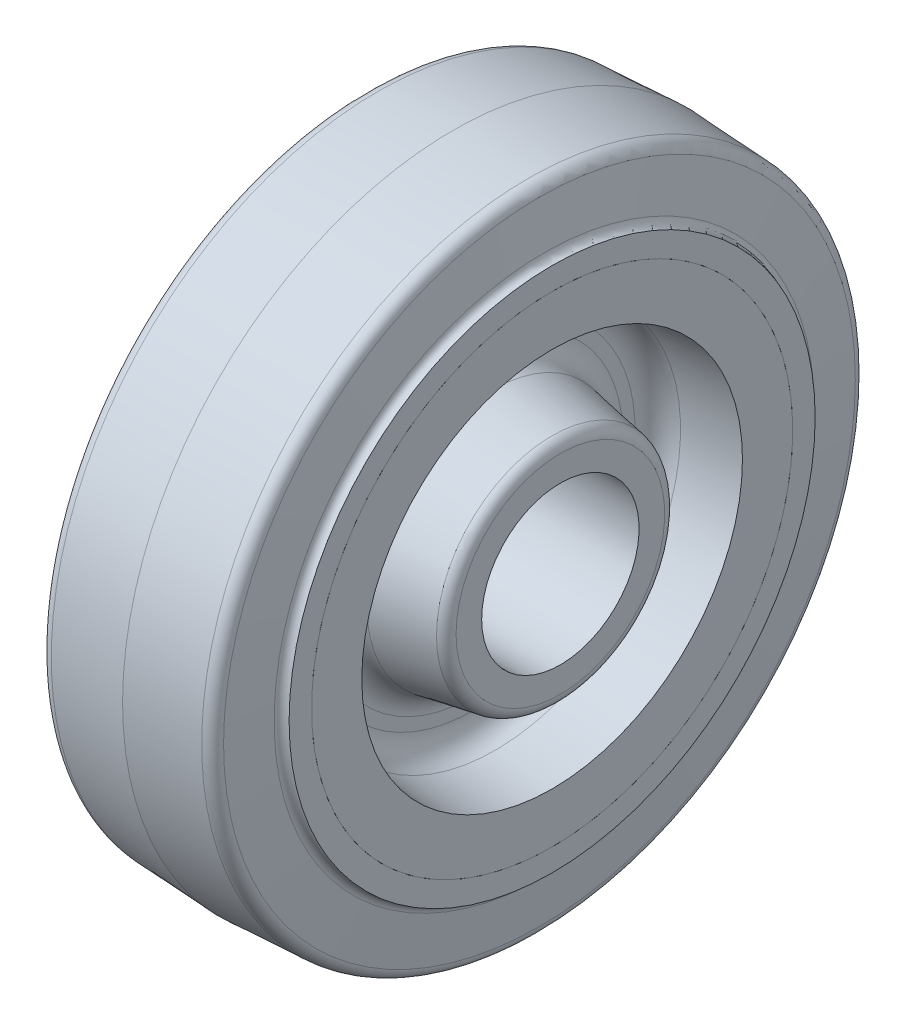
ISO-10303-21;
HEADER;
FILE_DESCRIPTION(('STEP AP214'),'2;1');
FILE_NAME('part.step','',(''),(''),'','','');
FILE_SCHEMA(('AUTOMOTIVE_DESIGN { 1 0 10303 214 1 1 1 1 }'));
ENDSEC;
DATA;
#1=APPLICATION_CONTEXT('core data for automotive mechanical design processes');
#2=APPLICATION_PROTOCOL_DEFINITION('international standard','automotive_design',2000,#1);
#3=PRODUCT_CONTEXT('',#1,'mechanical');
#4=PRODUCT('Part','Part','',(#3));
#5=PRODUCT_RELATED_PRODUCT_CATEGORY('part','',(#4));
#6=PRODUCT_DEFINITION_FORMATION('','',#4);
#7=PRODUCT_DEFINITION_CONTEXT('part definition',#1,'design');
#8=PRODUCT_DEFINITION('design','',#6,#7);
#9=PRODUCT_DEFINITION_SHAPE('','',#8);
#10=(LENGTH_UNIT() NAMED_UNIT(*) SI_UNIT(.MILLI.,.METRE.));
#11=(NAMED_UNIT(*) PLANE_ANGLE_UNIT() SI_UNIT($,.RADIAN.));
#12=(NAMED_UNIT(*) SI_UNIT($,.STERADIAN.) SOLID_ANGLE_UNIT());
#13=UNCERTAINTY_MEASURE_WITH_UNIT(LENGTH_MEASURE(1.E-05),#10,'distance_accuracy_value','');
#14=(GEOMETRIC_REPRESENTATION_CONTEXT(3) GLOBAL_UNCERTAINTY_ASSIGNED_CONTEXT((#13)) GLOBAL_UNIT_ASSIGNED_CONTEXT((#10,
#11,#12)) REPRESENTATION_CONTEXT('',''));
#15=CARTESIAN_POINT('',(0.,0.,0.));
#16=DIRECTION('',(0.,0.,1.));
#17=DIRECTION('',(1.,0.,0.));
#18=AXIS2_PLACEMENT_3D('',#15,#16,#17);
#19=CARTESIAN_POINT('',(19.05,50.546,0.));
#20=DIRECTION('',(1.,0.,0.));
#21=DIRECTION('',(0.,0.,-1.));
#22=AXIS2_PLACEMENT_3D('',#19,#20,#21);
#23=PLANE('',#22);
#24=CARTESIAN_POINT('',(19.05,0.,0.));
#25=DIRECTION('',(1.,0.,0.));
#26=DIRECTION('',(0.,0.,-1.));
#27=AXIS2_PLACEMENT_3D('',#24,#25,#26);
#28=CIRCLE('',#27,50.546);
#29=CARTESIAN_POINT('',(19.05,0.,-50.546));
#30=VERTEX_POINT('',#29);
#31=EDGE_CURVE('P0_E10',#30,#30,#28,.T.);
#32=ORIENTED_EDGE('',*,*,#31,.T.);
#33=EDGE_LOOP('',(#32));
#34=FACE_BOUND('',#33,.T.);
#35=CARTESIAN_POINT('',(19.05,0.,0.));
#36=DIRECTION('',(1.,0.,0.));
#37=DIRECTION('',(0.,0.,-1.));
#38=AXIS2_PLACEMENT_3D('',#35,#36,#37);
#39=CIRCLE('',#38,46.228);
#40=CARTESIAN_POINT('',(19.05,0.,-46.228));
#41=VERTEX_POINT('',#40);
#42=EDGE_CURVE('P0_E63',#41,#41,#39,.T.);
#43=ORIENTED_EDGE('',*,*,#42,.F.);
#44=EDGE_LOOP('',(#43));
#45=FACE_BOUND('',#44,.T.);
#46=ADVANCED_FACE('P0_F14',(#34,#45),#23,.T.);
#47=CARTESIAN_POINT('',(19.05,0.,0.));
#48=DIRECTION('',(1.,0.,0.));
#49=DIRECTION('',(0.,0.,-1.));
#50=AXIS2_PLACEMENT_3D('',#47,#48,#49);
#51=TOROIDAL_SURFACE('',#50,52.07,1.524);
#52=CARTESIAN_POINT('',(17.5343486314588,0.,0.));
#53=DIRECTION('',(1.,0.,0.));
#54=DIRECTION('',(0.,0.,-1.));
#55=AXIS2_PLACEMENT_3D('',#52,#53,#54);
#56=CIRCLE('',#55,51.9106986219801);
#57=CARTESIAN_POINT('',(17.5343486314588,0.,-51.9106986219801));
#58=VERTEX_POINT('',#57);
#59=EDGE_CURVE('P0_E20',#58,#58,#56,.T.);
#60=ORIENTED_EDGE('',*,*,#59,.T.);
#61=EDGE_LOOP('',(#60));
#62=FACE_BOUND('',#61,.T.);
#63=ORIENTED_EDGE('',*,*,#31,.F.);
#64=EDGE_LOOP('',(#63));
#65=FACE_BOUND('',#64,.T.);
#66=ADVANCED_FACE('P0_F71',(#62,#65),#51,.F.);
#67=CARTESIAN_POINT('',(17.5343486314588,0.,0.));
#68=DIRECTION('',(-1.,0.,0.));
#69=DIRECTION('',(0.,0.,1.));
#70=AXIS2_PLACEMENT_3D('',#67,#68,#69);
#71=CONICAL_SURFACE('',#70,51.9106986219801,1.46607657167524);
#72=CARTESIAN_POINT('',(16.6107206575658,0.,0.));
#73=DIRECTION('',(1.,0.,0.));
#74=DIRECTION('',(0.,0.,-1.));
#75=AXIS2_PLACEMENT_3D('',#72,#73,#74);
#76=CIRCLE('',#75,60.6984317857136);
#77=CARTESIAN_POINT('',(16.6107206575658,0.,-60.6984317857136));
#78=VERTEX_POINT('',#77);
#79=EDGE_CURVE('P0_E24',#78,#78,#76,.T.);
#80=ORIENTED_EDGE('',*,*,#79,.T.);
#81=EDGE_LOOP('',(#80));
#82=FACE_BOUND('',#81,.T.);
#83=ORIENTED_EDGE('',*,*,#59,.F.);
#84=EDGE_LOOP('',(#83));
#85=FACE_BOUND('',#84,.T.);
#86=ADVANCED_FACE('P0_F76',(#82,#85),#71,.T.);
#87=CARTESIAN_POINT('',(14.3372436047539,0.,0.));
#88=DIRECTION('',(1.,0.,0.));
#89=DIRECTION('',(0.,0.,-1.));
#90=AXIS2_PLACEMENT_3D('',#87,#88,#89);
#91=TOROIDAL_SURFACE('',#90,60.4594797186837,2.286);
#92=CARTESIAN_POINT('',(14.4568836007253,0.,0.));
#93=DIRECTION('',(1.,0.,0.));
#94=DIRECTION('',(0.,0.,-1.));
#95=AXIS2_PLACEMENT_3D('',#92,#93,#94);
#96=CIRCLE('',#95,62.7423468351327);
#97=CARTESIAN_POINT('',(14.4568836007253,0.,-62.7423468351327));
#98=VERTEX_POINT('',#97);
#99=EDGE_CURVE('P0_E28',#98,#98,#96,.T.);
#100=ORIENTED_EDGE('',*,*,#99,.T.);
#101=EDGE_LOOP('',(#100));
#102=FACE_BOUND('',#101,.T.);
#103=ORIENTED_EDGE('',*,*,#79,.F.);
#104=EDGE_LOOP('',(#103));
#105=FACE_BOUND('',#104,.T.);
#106=ADVANCED_FACE('P0_F80',(#102,#105),#91,.T.);
#107=CARTESIAN_POINT('',(14.4568836007253,0.,0.));
#108=DIRECTION('',(-1.,0.,0.));
#109=DIRECTION('',(0.,0.,1.));
#110=AXIS2_PLACEMENT_3D('',#107,#108,#109);
#111=CONICAL_SURFACE('',#110,62.7423468351327,0.0523598775598219);
#112=CARTESIAN_POINT('',(0.,0.,0.));
#113=DIRECTION('',(1.,0.,0.));
#114=DIRECTION('',(0.,0.,-1.));
#115=AXIS2_PLACEMENT_3D('',#112,#113,#114);
#116=CIRCLE('',#115,63.5);
#117=CARTESIAN_POINT('',(0.,0.,-63.5));
#118=VERTEX_POINT('',#117);
#119=EDGE_CURVE('P0_E33',#118,#118,#116,.T.);
#120=ORIENTED_EDGE('',*,*,#119,.T.);
#121=EDGE_LOOP('',(#120));
#122=FACE_BOUND('',#121,.T.);
#123=ORIENTED_EDGE('',*,*,#99,.F.);
#124=EDGE_LOOP('',(#123));
#125=FACE_BOUND('',#124,.T.);
#126=ADVANCED_FACE('P0_F87',(#122,#125),#111,.T.);
#127=CARTESIAN_POINT('',(0.,0.,0.));
#128=DIRECTION('',(1.,0.,0.));
#129=DIRECTION('',(0.,0.,-1.));
#130=AXIS2_PLACEMENT_3D('',#127,#128,#129);
#131=CONICAL_SURFACE('',#130,63.5,0.0523598775598228);
#132=CARTESIAN_POINT('',(-14.4568836007253,0.,0.));
#133=DIRECTION('',(1.,0.,0.));
#134=DIRECTION('',(0.,0.,-1.));
#135=AXIS2_PLACEMENT_3D('',#132,#133,#134);
#136=CIRCLE('',#135,62.7423468351327);
#137=CARTESIAN_POINT('',(-14.4568836007253,0.,-62.7423468351327));
#138=VERTEX_POINT('',#137);
#139=EDGE_CURVE('P0_E36',#138,#138,#136,.T.);
#140=ORIENTED_EDGE('',*,*,#139,.T.);
#141=EDGE_LOOP('',(#140));
#142=FACE_BOUND('',#141,.T.);
#143=ORIENTED_EDGE('',*,*,#119,.F.);
#144=EDGE_LOOP('',(#143));
#145=FACE_BOUND('',#144,.T.);
#146=ADVANCED_FACE('P0_F91',(#142,#145),#131,.T.);
#147=CARTESIAN_POINT('',(-14.3372436047539,0.,0.));
#148=DIRECTION('',(1.,0.,0.));
#149=DIRECTION('',(0.,0.,-1.));
#150=AXIS2_PLACEMENT_3D('',#147,#148,#149);
#151=TOROIDAL_SURFACE('',#150,60.4594797186837,2.286);
#152=CARTESIAN_POINT('',(-16.6107206575658,0.,0.));
#153=DIRECTION('',(1.,0.,0.));
#154=DIRECTION('',(0.,0.,-1.));
#155=AXIS2_PLACEMENT_3D('',#152,#153,#154);
#156=CIRCLE('',#155,60.6984317857136);
#157=CARTESIAN_POINT('',(-16.6107206575658,0.,-60.6984317857136));
#158=VERTEX_POINT('',#157);
#159=EDGE_CURVE('P0_E39',#158,#158,#156,.T.);
#160=ORIENTED_EDGE('',*,*,#159,.T.);
#161=EDGE_LOOP('',(#160));
#162=FACE_BOUND('',#161,.T.);
#163=ORIENTED_EDGE('',*,*,#139,.F.);
#164=EDGE_LOOP('',(#163));
#165=FACE_BOUND('',#164,.T.);
#166=ADVANCED_FACE('P0_F95',(#162,#165),#151,.T.);
#167=CARTESIAN_POINT('',(-16.6107206575658,0.,0.));
#168=DIRECTION('',(1.,0.,0.));
#169=DIRECTION('',(0.,0.,-1.));
#170=AXIS2_PLACEMENT_3D('',#167,#168,#169);
#171=CONICAL_SURFACE('',#170,60.6984317857136,1.46607657167524);
#172=CARTESIAN_POINT('',(-17.5343486314587,0.,0.));
#173=DIRECTION('',(1.,0.,0.));
#174=DIRECTION('',(0.,0.,-1.));
#175=AXIS2_PLACEMENT_3D('',#172,#173,#174);
#176=CIRCLE('',#175,51.9106986219801);
#177=CARTESIAN_POINT('',(-17.5343486314587,0.,-51.9106986219801));
#178=VERTEX_POINT('',#177);
#179=EDGE_CURVE('P0_E42',#178,#178,#176,.T.);
#180=ORIENTED_EDGE('',*,*,#179,.T.);
#181=EDGE_LOOP('',(#180));
#182=FACE_BOUND('',#181,.T.);
#183=ORIENTED_EDGE('',*,*,#159,.F.);
#184=EDGE_LOOP('',(#183));
#185=FACE_BOUND('',#184,.T.);
#186=ADVANCED_FACE('P0_F99',(#182,#185),#171,.T.);
#187=CARTESIAN_POINT('',(-19.05,0.,0.));
#188=DIRECTION('',(1.,0.,0.));
#189=DIRECTION('',(0.,0.,-1.));
#190=AXIS2_PLACEMENT_3D('',#187,#188,#189);
#191=TOROIDAL_SURFACE('',#190,52.07,1.524);
#192=CARTESIAN_POINT('',(-19.05,0.,0.));
#193=DIRECTION('',(1.,0.,0.));
#194=DIRECTION('',(0.,0.,-1.));
#195=AXIS2_PLACEMENT_3D('',#192,#193,#194);
#196=CIRCLE('',#195,50.546);
#197=CARTESIAN_POINT('',(-19.05,0.,-50.546));
#198=VERTEX_POINT('',#197);
#199=EDGE_CURVE('P0_E45',#198,#198,#196,.T.);
#200=ORIENTED_EDGE('',*,*,#199,.T.);
#201=EDGE_LOOP('',(#200));
#202=FACE_BOUND('',#201,.T.);
#203=ORIENTED_EDGE('',*,*,#179,.F.);
#204=EDGE_LOOP('',(#203));
#205=FACE_BOUND('',#204,.T.);
#206=ADVANCED_FACE('P0_F103',(#202,#205),#191,.F.);
#207=CARTESIAN_POINT('',(-19.05,46.228,0.));
#208=DIRECTION('',(-1.,0.,0.));
#209=DIRECTION('',(0.,0.,1.));
#210=AXIS2_PLACEMENT_3D('',#207,#208,#209);
#211=PLANE('',#210);
#212=CARTESIAN_POINT('',(-19.05,0.,0.));
#213=DIRECTION('',(1.,0.,0.));
#214=DIRECTION('',(0.,0.,-1.));
#215=AXIS2_PLACEMENT_3D('',#212,#213,#214);
#216=CIRCLE('',#215,46.228);
#217=CARTESIAN_POINT('',(-19.05,0.,-46.228));
#218=VERTEX_POINT('',#217);
#219=EDGE_CURVE('P0_E48',#218,#218,#216,.T.);
#220=ORIENTED_EDGE('',*,*,#219,.T.);
#221=EDGE_LOOP('',(#220));
#222=FACE_BOUND('',#221,.T.);
#223=ORIENTED_EDGE('',*,*,#199,.F.);
#224=EDGE_LOOP('',(#223));
#225=FACE_BOUND('',#224,.T.);
#226=ADVANCED_FACE('P0_F107',(#222,#225),#211,.T.);
#227=CARTESIAN_POINT('',(0.,0.,0.));
#228=DIRECTION('',(1.,0.,0.));
#229=DIRECTION('',(0.,0.,-1.));
#230=AXIS2_PLACEMENT_3D('',#227,#228,#229);
#231=CYLINDRICAL_SURFACE('',#230,46.228);
#232=CARTESIAN_POINT('',(-12.7,0.,0.));
#233=DIRECTION('',(1.,0.,0.));
#234=DIRECTION('',(0.,0.,-1.));
#235=AXIS2_PLACEMENT_3D('',#232,#233,#234);
#236=CIRCLE('',#235,46.228);
#237=CARTESIAN_POINT('',(-12.7,0.,-46.228));
#238=VERTEX_POINT('',#237);
#239=EDGE_CURVE('P0_E51',#238,#238,#236,.T.);
#240=ORIENTED_EDGE('',*,*,#239,.T.);
#241=EDGE_LOOP('',(#240));
#242=FACE_BOUND('',#241,.T.);
#243=ORIENTED_EDGE('',*,*,#219,.F.);
#244=EDGE_LOOP('',(#243));
#245=FACE_BOUND('',#244,.T.);
#246=ADVANCED_FACE('P0_F111',(#242,#245),#231,.F.);
#247=CARTESIAN_POINT('',(-12.7,53.848,0.));
#248=DIRECTION('',(1.,0.,0.));
#249=DIRECTION('',(0.,0.,-1.));
#250=AXIS2_PLACEMENT_3D('',#247,#248,#249);
#251=PLANE('',#250);
#252=CARTESIAN_POINT('',(-12.7,0.,0.));
#253=DIRECTION('',(1.,0.,0.));
#254=DIRECTION('',(0.,0.,-1.));
#255=AXIS2_PLACEMENT_3D('',#252,#253,#254);
#256=CIRCLE('',#255,53.848);
#257=CARTESIAN_POINT('',(-12.7,0.,-53.848));
#258=VERTEX_POINT('',#257);
#259=EDGE_CURVE('P0_E54',#258,#258,#256,.T.);
#260=ORIENTED_EDGE('',*,*,#259,.T.);
#261=EDGE_LOOP('',(#260));
#262=FACE_BOUND('',#261,.T.);
#263=ORIENTED_EDGE('',*,*,#239,.F.);
#264=EDGE_LOOP('',(#263));
#265=FACE_BOUND('',#264,.T.);
#266=ADVANCED_FACE('P0_F115',(#262,#265),#251,.T.);
#267=CARTESIAN_POINT('',(0.,0.,0.));
#268=DIRECTION('',(1.,0.,0.));
#269=DIRECTION('',(0.,0.,-1.));
#270=AXIS2_PLACEMENT_3D('',#267,#268,#269);
#271=CYLINDRICAL_SURFACE('',#270,53.848);
#272=CARTESIAN_POINT('',(12.7,0.,0.));
#273=DIRECTION('',(1.,0.,0.));
#274=DIRECTION('',(0.,0.,-1.));
#275=AXIS2_PLACEMENT_3D('',#272,#273,#274);
#276=CIRCLE('',#275,53.848);
#277=CARTESIAN_POINT('',(12.7,0.,-53.848));
#278=VERTEX_POINT('',#277);
#279=EDGE_CURVE('P0_E57',#278,#278,#276,.T.);
#280=ORIENTED_EDGE('',*,*,#279,.T.);
#281=EDGE_LOOP('',(#280));
#282=FACE_BOUND('',#281,.T.);
#283=ORIENTED_EDGE('',*,*,#259,.F.);
#284=EDGE_LOOP('',(#283));
#285=FACE_BOUND('',#284,.T.);
#286=ADVANCED_FACE('P0_F119',(#282,#285),#271,.F.);
#287=CARTESIAN_POINT('',(12.7,46.228,0.));
#288=DIRECTION('',(-1.,0.,0.));
#289=DIRECTION('',(0.,0.,1.));
#290=AXIS2_PLACEMENT_3D('',#287,#288,#289);
#291=PLANE('',#290);
#292=CARTESIAN_POINT('',(12.7,0.,0.));
#293=DIRECTION('',(1.,0.,0.));
#294=DIRECTION('',(0.,0.,-1.));
#295=AXIS2_PLACEMENT_3D('',#292,#293,#294);
#296=CIRCLE('',#295,46.228);
#297=CARTESIAN_POINT('',(12.7,0.,-46.228));
#298=VERTEX_POINT('',#297);
#299=EDGE_CURVE('P0_E60',#298,#298,#296,.T.);
#300=ORIENTED_EDGE('',*,*,#299,.T.);
#301=EDGE_LOOP('',(#300));
#302=FACE_BOUND('',#301,.T.);
#303=ORIENTED_EDGE('',*,*,#279,.F.);
#304=EDGE_LOOP('',(#303));
#305=FACE_BOUND('',#304,.T.);
#306=ADVANCED_FACE('P0_F123',(#302,#305),#291,.T.);
#307=CARTESIAN_POINT('',(0.,0.,0.));
#308=DIRECTION('',(1.,0.,0.));
#309=DIRECTION('',(0.,0.,-1.));
#310=AXIS2_PLACEMENT_3D('',#307,#308,#309);
#311=CYLINDRICAL_SURFACE('',#310,46.228);
#312=ORIENTED_EDGE('',*,*,#42,.T.);
#313=EDGE_LOOP('',(#312));
#314=FACE_BOUND('',#313,.T.);
#315=ORIENTED_EDGE('',*,*,#299,.F.);
#316=EDGE_LOOP('',(#315));
#317=FACE_BOUND('',#316,.T.);
#318=ADVANCED_FACE('P0_F67',(#314,#317),#311,.F.);
#319=CLOSED_SHELL('',(#46,#66,#86,#106,#126,#146,#166,#186,#206,#226,#246,#266,#286,#306,#318));
#320=MANIFOLD_SOLID_BREP('P0_B1',#319);
#321=CARTESIAN_POINT('',(19.05,46.228,0.));
#322=DIRECTION('',(-1.,0.,0.));
#323=DIRECTION('',(0.,0.,1.));
#324=AXIS2_PLACEMENT_3D('',#321,#322,#323);
#325=PLANE('',#324);
#326=CARTESIAN_POINT('',(19.05,0.,0.));
#327=DIRECTION('',(-1.,0.,0.));
#328=DIRECTION('',(0.,0.,1.));
#329=AXIS2_PLACEMENT_3D('',#326,#327,#328);
#330=CIRCLE('',#329,46.228);
#331=CARTESIAN_POINT('',(19.05,0.,46.228));
#332=VERTEX_POINT('',#331);
#333=EDGE_CURVE('P1_E43',#332,#332,#330,.T.);
#334=ORIENTED_EDGE('',*,*,#333,.F.);
#335=EDGE_LOOP('',(#334));
#336=FACE_BOUND('',#335,.T.);
#337=CARTESIAN_POINT('',(19.05,0.,0.));
#338=DIRECTION('',(-1.,0.,0.));
#339=DIRECTION('',(0.,0.,1.));
#340=AXIS2_PLACEMENT_3D('',#337,#338,#339);
#341=CIRCLE('',#340,36.576);
#342=CARTESIAN_POINT('',(19.05,0.,36.576));
#343=VERTEX_POINT('',#342);
#344=EDGE_CURVE('P1_E79',#343,#343,#341,.T.);
#345=ORIENTED_EDGE('',*,*,#344,.T.);
#346=EDGE_LOOP('',(#345));
#347=FACE_BOUND('',#346,.T.);
#348=ADVANCED_FACE('P1_F14',(#336,#347),#325,.F.);
#349=CARTESIAN_POINT('',(-19.05,22.225,0.));
#350=DIRECTION('',(1.,0.,0.));
#351=DIRECTION('',(0.,0.,-1.));
#352=AXIS2_PLACEMENT_3D('',#349,#350,#351);
#353=PLANE('',#352);
#354=CARTESIAN_POINT('',(-19.05,0.,0.));
#355=DIRECTION('',(-1.,0.,0.));
#356=DIRECTION('',(0.,0.,1.));
#357=AXIS2_PLACEMENT_3D('',#354,#355,#356);
#358=CIRCLE('',#357,46.228);
#359=CARTESIAN_POINT('',(-19.05,0.,46.228));
#360=VERTEX_POINT('',#359);
#361=EDGE_CURVE('P1_E25',#360,#360,#358,.T.);
#362=ORIENTED_EDGE('',*,*,#361,.T.);
#363=EDGE_LOOP('',(#362));
#364=FACE_BOUND('',#363,.T.);
#365=CARTESIAN_POINT('',(-19.05,0.,0.));
#366=DIRECTION('',(-1.,0.,0.));
#367=DIRECTION('',(0.,0.,1.));
#368=AXIS2_PLACEMENT_3D('',#365,#366,#367);
#369=CIRCLE('',#368,36.576);
#370=CARTESIAN_POINT('',(-19.05,0.,36.576));
#371=VERTEX_POINT('',#370);
#372=EDGE_CURVE('P1_E67',#371,#371,#369,.T.);
#373=ORIENTED_EDGE('',*,*,#372,.F.);
#374=EDGE_LOOP('',(#373));
#375=FACE_BOUND('',#374,.T.);
#376=ADVANCED_FACE('P1_F106',(#364,#375),#353,.F.);
#377=CARTESIAN_POINT('',(-20.6375,15.1257,0.));
#378=DIRECTION('',(1.,0.,0.));
#379=DIRECTION('',(0.,0.,-1.));
#380=AXIS2_PLACEMENT_3D('',#377,#378,#379);
#381=PLANE('',#380);
#382=CARTESIAN_POINT('',(-20.6375,0.,0.));
#383=DIRECTION('',(1.,0.,0.));
#384=DIRECTION('',(0.,0.,-1.));
#385=AXIS2_PLACEMENT_3D('',#382,#383,#384);
#386=CIRCLE('',#385,20.0483296643727);
#387=CARTESIAN_POINT('',(-20.6375,0.,-20.0483296643727));
#388=VERTEX_POINT('',#387);
#389=EDGE_CURVE('P1_E21',#388,#388,#386,.F.);
#390=ORIENTED_EDGE('',*,*,#389,.T.);
#391=EDGE_LOOP('',(#390));
#392=FACE_BOUND('',#391,.T.);
#393=CARTESIAN_POINT('',(-20.6375,0.,0.));
#394=DIRECTION('',(-1.,0.,0.));
#395=DIRECTION('',(0.,0.,1.));
#396=AXIS2_PLACEMENT_3D('',#393,#394,#395);
#397=CIRCLE('',#396,15.1257);
#398=CARTESIAN_POINT('',(-20.6375,0.,15.1257));
#399=VERTEX_POINT('',#398);
#400=EDGE_CURVE('P1_E49',#399,#399,#397,.T.);
#401=ORIENTED_EDGE('',*,*,#400,.F.);
#402=EDGE_LOOP('',(#401));
#403=FACE_BOUND('',#402,.T.);
#404=ADVANCED_FACE('P1_F113',(#392,#403),#381,.F.);
#405=CARTESIAN_POINT('',(-72.5714285714286,0.,0.));
#406=DIRECTION('',(-1.,0.,0.));
#407=DIRECTION('',(0.,0.,1.));
#408=AXIS2_PLACEMENT_3D('',#405,#406,#407);
#409=CYLINDRICAL_SURFACE('',#408,46.228);
#410=ORIENTED_EDGE('',*,*,#361,.F.);
#411=EDGE_LOOP('',(#410));
#412=FACE_BOUND('',#411,.T.);
#413=CARTESIAN_POINT('',(-12.7,0.,0.));
#414=DIRECTION('',(-1.,0.,0.));
#415=DIRECTION('',(0.,0.,1.));
#416=AXIS2_PLACEMENT_3D('',#413,#414,#415);
#417=CIRCLE('',#416,46.228);
#418=CARTESIAN_POINT('',(-12.7,0.,46.228));
#419=VERTEX_POINT('',#418);
#420=EDGE_CURVE('P1_E29',#419,#419,#417,.T.);
#421=ORIENTED_EDGE('',*,*,#420,.T.);
#422=EDGE_LOOP('',(#421));
#423=FACE_BOUND('',#422,.T.);
#424=ADVANCED_FACE('P1_F137',(#412,#423),#409,.T.);
#425=CARTESIAN_POINT('',(-12.7,46.228,0.));
#426=DIRECTION('',(1.,0.,0.));
#427=DIRECTION('',(0.,0.,-1.));
#428=AXIS2_PLACEMENT_3D('',#425,#426,#427);
#429=PLANE('',#428);
#430=ORIENTED_EDGE('',*,*,#420,.F.);
#431=EDGE_LOOP('',(#430));
#432=FACE_BOUND('',#431,.T.);
#433=CARTESIAN_POINT('',(-12.7,0.,0.));
#434=DIRECTION('',(-1.,0.,0.));
#435=DIRECTION('',(0.,0.,1.));
#436=AXIS2_PLACEMENT_3D('',#433,#434,#435);
#437=CIRCLE('',#436,53.848);
#438=CARTESIAN_POINT('',(-12.7,0.,53.848));
#439=VERTEX_POINT('',#438);
#440=EDGE_CURVE('P1_E34',#439,#439,#437,.T.);
#441=ORIENTED_EDGE('',*,*,#440,.T.);
#442=EDGE_LOOP('',(#441));
#443=FACE_BOUND('',#442,.T.);
#444=ADVANCED_FACE('P1_F133',(#432,#443),#429,.F.);
#445=CARTESIAN_POINT('',(-72.5714285714286,0.,0.));
#446=DIRECTION('',(-1.,0.,0.));
#447=DIRECTION('',(0.,0.,1.));
#448=AXIS2_PLACEMENT_3D('',#445,#446,#447);
#449=CYLINDRICAL_SURFACE('',#448,53.848);
#450=ORIENTED_EDGE('',*,*,#440,.F.);
#451=EDGE_LOOP('',(#450));
#452=FACE_BOUND('',#451,.T.);
#453=CARTESIAN_POINT('',(12.7,0.,0.));
#454=DIRECTION('',(-1.,0.,0.));
#455=DIRECTION('',(0.,0.,1.));
#456=AXIS2_PLACEMENT_3D('',#453,#454,#455);
#457=CIRCLE('',#456,53.848);
#458=CARTESIAN_POINT('',(12.7,0.,53.848));
#459=VERTEX_POINT('',#458);
#460=EDGE_CURVE('P1_E37',#459,#459,#457,.T.);
#461=ORIENTED_EDGE('',*,*,#460,.T.);
#462=EDGE_LOOP('',(#461));
#463=FACE_BOUND('',#462,.T.);
#464=ADVANCED_FACE('P1_F129',(#452,#463),#449,.T.);
#465=CARTESIAN_POINT('',(12.7,53.848,0.));
#466=DIRECTION('',(-1.,0.,0.));
#467=DIRECTION('',(0.,0.,1.));
#468=AXIS2_PLACEMENT_3D('',#465,#466,#467);
#469=PLANE('',#468);
#470=ORIENTED_EDGE('',*,*,#460,.F.);
#471=EDGE_LOOP('',(#470));
#472=FACE_BOUND('',#471,.T.);
#473=CARTESIAN_POINT('',(12.7,0.,0.));
#474=DIRECTION('',(-1.,0.,0.));
#475=DIRECTION('',(0.,0.,1.));
#476=AXIS2_PLACEMENT_3D('',#473,#474,#475);
#477=CIRCLE('',#476,46.228);
#478=CARTESIAN_POINT('',(12.7,0.,46.228));
#479=VERTEX_POINT('',#478);
#480=EDGE_CURVE('P1_E40',#479,#479,#477,.T.);
#481=ORIENTED_EDGE('',*,*,#480,.T.);
#482=EDGE_LOOP('',(#481));
#483=FACE_BOUND('',#482,.T.);
#484=ADVANCED_FACE('P1_F125',(#472,#483),#469,.F.);
#485=CARTESIAN_POINT('',(-72.5714285714286,0.,0.));
#486=DIRECTION('',(-1.,0.,0.));
#487=DIRECTION('',(0.,0.,1.));
#488=AXIS2_PLACEMENT_3D('',#485,#486,#487);
#489=CYLINDRICAL_SURFACE('',#488,46.228);
#490=ORIENTED_EDGE('',*,*,#480,.F.);
#491=EDGE_LOOP('',(#490));
#492=FACE_BOUND('',#491,.T.);
#493=ORIENTED_EDGE('',*,*,#333,.T.);
#494=EDGE_LOOP('',(#493));
#495=FACE_BOUND('',#494,.T.);
#496=ADVANCED_FACE('P1_F122',(#492,#495),#489,.T.);
#497=CARTESIAN_POINT('',(20.6375,15.1257,0.));
#498=DIRECTION('',(-1.,0.,0.));
#499=DIRECTION('',(0.,0.,1.));
#500=AXIS2_PLACEMENT_3D('',#497,#498,#499);
#501=PLANE('',#500);
#502=CARTESIAN_POINT('',(20.6375,0.,0.));
#503=DIRECTION('',(-1.,0.,0.));
#504=DIRECTION('',(0.,0.,1.));
#505=AXIS2_PLACEMENT_3D('',#502,#503,#504);
#506=CIRCLE('',#505,20.0483296643727);
#507=CARTESIAN_POINT('',(20.6375,0.,20.0483296643727));
#508=VERTEX_POINT('',#507);
#509=EDGE_CURVE('P1_E10',#508,#508,#506,.F.);
#510=ORIENTED_EDGE('',*,*,#509,.T.);
#511=EDGE_LOOP('',(#510));
#512=FACE_BOUND('',#511,.T.);
#513=CARTESIAN_POINT('',(20.6375,0.,0.));
#514=DIRECTION('',(-1.,0.,0.));
#515=DIRECTION('',(0.,0.,1.));
#516=AXIS2_PLACEMENT_3D('',#513,#514,#515);
#517=CIRCLE('',#516,15.1257);
#518=CARTESIAN_POINT('',(20.6375,0.,15.1257));
#519=VERTEX_POINT('',#518);
#520=EDGE_CURVE('P1_E46',#519,#519,#517,.T.);
#521=ORIENTED_EDGE('',*,*,#520,.T.);
#522=EDGE_LOOP('',(#521));
#523=FACE_BOUND('',#522,.T.);
#524=ADVANCED_FACE('P1_F120',(#512,#523),#501,.F.);
#525=CARTESIAN_POINT('',(-72.5714285714286,0.,0.));
#526=DIRECTION('',(-1.,0.,0.));
#527=DIRECTION('',(0.,0.,1.));
#528=AXIS2_PLACEMENT_3D('',#525,#526,#527);
#529=CYLINDRICAL_SURFACE('',#528,15.1257);
#530=ORIENTED_EDGE('',*,*,#520,.F.);
#531=EDGE_LOOP('',(#530));
#532=FACE_BOUND('',#531,.T.);
#533=ORIENTED_EDGE('',*,*,#400,.T.);
#534=EDGE_LOOP('',(#533));
#535=FACE_BOUND('',#534,.T.);
#536=ADVANCED_FACE('P1_F145',(#532,#535),#529,.F.);
#537=CARTESIAN_POINT('',(-18.3515,0.,0.));
#538=DIRECTION('',(-1.,0.,0.));
#539=DIRECTION('',(0.,0.,1.));
#540=AXIS2_PLACEMENT_3D('',#537,#538,#539);
#541=TOROIDAL_SURFACE('',#540,20.0483296643727,2.286);
#542=CARTESIAN_POINT('',(-19.05,0.,0.));
#543=DIRECTION('',(-1.,0.,0.));
#544=DIRECTION('',(0.,0.,1.));
#545=AXIS2_PLACEMENT_3D('',#542,#543,#544);
#546=CIRCLE('',#545,22.225);
#547=CARTESIAN_POINT('',(-19.05,0.,22.225));
#548=VERTEX_POINT('',#547);
#549=EDGE_CURVE('P1_E64',#548,#548,#546,.T.);
#550=ORIENTED_EDGE('',*,*,#549,.T.);
#551=EDGE_LOOP('',(#550));
#552=FACE_BOUND('',#551,.T.);
#553=ORIENTED_EDGE('',*,*,#389,.F.);
#554=EDGE_LOOP('',(#553));
#555=FACE_BOUND('',#554,.T.);
#556=ADVANCED_FACE('P1_F143',(#552,#555),#541,.T.);
#557=CARTESIAN_POINT('',(18.3515,0.,0.));
#558=DIRECTION('',(1.,0.,0.));
#559=DIRECTION('',(0.,0.,-1.));
#560=AXIS2_PLACEMENT_3D('',#557,#558,#559);
#561=TOROIDAL_SURFACE('',#560,20.0483296643727,2.286);
#562=ORIENTED_EDGE('',*,*,#509,.F.);
#563=EDGE_LOOP('',(#562));
#564=FACE_BOUND('',#563,.T.);
#565=CARTESIAN_POINT('',(19.05,0.,0.));
#566=DIRECTION('',(-1.,0.,0.));
#567=DIRECTION('',(0.,0.,1.));
#568=AXIS2_PLACEMENT_3D('',#565,#566,#567);
#569=CIRCLE('',#568,22.225);
#570=CARTESIAN_POINT('',(19.05,0.,22.225));
#571=VERTEX_POINT('',#570);
#572=EDGE_CURVE('P1_E82',#571,#571,#569,.T.);
#573=ORIENTED_EDGE('',*,*,#572,.F.);
#574=EDGE_LOOP('',(#573));
#575=FACE_BOUND('',#574,.T.);
#576=ADVANCED_FACE('P1_F16',(#564,#575),#561,.T.);
#577=CARTESIAN_POINT('',(-8.1105239441577,0.,0.));
#578=DIRECTION('',(-1.,0.,0.));
#579=DIRECTION('',(0.,0.,1.));
#580=AXIS2_PLACEMENT_3D('',#577,#578,#579);
#581=CONICAL_SURFACE('',#580,35.6189198602005,0.0872664625997166);
#582=ORIENTED_EDGE('',*,*,#372,.T.);
#583=EDGE_LOOP('',(#582));
#584=FACE_BOUND('',#583,.T.);
#585=CARTESIAN_POINT('',(-8.1105239441577,0.,0.));
#586=DIRECTION('',(-1.,0.,0.));
#587=DIRECTION('',(0.,0.,1.));
#588=AXIS2_PLACEMENT_3D('',#585,#586,#587);
#589=CIRCLE('',#588,35.6189198602005);
#590=CARTESIAN_POINT('',(-8.1105239441577,0.,35.6189198602005));
#591=VERTEX_POINT('',#590);
#592=EDGE_CURVE('P1_E52',#591,#591,#589,.T.);
#593=ORIENTED_EDGE('',*,*,#592,.F.);
#594=EDGE_LOOP('',(#593));
#595=FACE_BOUND('',#594,.T.);
#596=ADVANCED_FACE('P1_F152',(#584,#595),#581,.F.);
#597=CARTESIAN_POINT('',(-8.509,0.,0.));
#598=DIRECTION('',(-1.,0.,0.));
#599=DIRECTION('',(0.,0.,1.));
#600=AXIS2_PLACEMENT_3D('',#597,#598,#599);
#601=TOROIDAL_SURFACE('',#600,31.064317700525,4.572);
#602=ORIENTED_EDGE('',*,*,#592,.T.);
#603=EDGE_LOOP('',(#602));
#604=FACE_BOUND('',#603,.T.);
#605=CARTESIAN_POINT('',(-3.937,0.,0.));
#606=DIRECTION('',(-1.,0.,0.));
#607=DIRECTION('',(0.,0.,1.));
#608=AXIS2_PLACEMENT_3D('',#605,#606,#607);
#609=CIRCLE('',#608,31.064317700525);
#610=CARTESIAN_POINT('',(-3.937,0.,31.064317700525));
#611=VERTEX_POINT('',#610);
#612=EDGE_CURVE('P1_E55',#611,#611,#609,.T.);
#613=ORIENTED_EDGE('',*,*,#612,.F.);
#614=EDGE_LOOP('',(#613));
#615=FACE_BOUND('',#614,.T.);
#616=ADVANCED_FACE('P1_F177',(#604,#615),#601,.F.);
#617=CARTESIAN_POINT('',(-3.937,31.064317700525,0.));
#618=DIRECTION('',(-1.,0.,0.));
#619=DIRECTION('',(0.,0.,1.));
#620=AXIS2_PLACEMENT_3D('',#617,#618,#619);
#621=PLANE('',#620);
#622=ORIENTED_EDGE('',*,*,#612,.T.);
#623=EDGE_LOOP('',(#622));
#624=FACE_BOUND('',#623,.T.);
#625=CARTESIAN_POINT('',(-3.937,0.,0.));
#626=DIRECTION('',(-1.,0.,0.));
#627=DIRECTION('',(0.,0.,1.));
#628=AXIS2_PLACEMENT_3D('',#625,#626,#627);
#629=CIRCLE('',#628,28.7261931731896);
#630=CARTESIAN_POINT('',(-3.937,0.,28.7261931731896));
#631=VERTEX_POINT('',#630);
#632=EDGE_CURVE('P1_E58',#631,#631,#629,.T.);
#633=ORIENTED_EDGE('',*,*,#632,.F.);
#634=EDGE_LOOP('',(#633));
#635=FACE_BOUND('',#634,.T.);
#636=ADVANCED_FACE('P1_F170',(#624,#635),#621,.T.);
#637=CARTESIAN_POINT('',(-8.509,0.,0.));
#638=DIRECTION('',(-1.,0.,0.));
#639=DIRECTION('',(0.,0.,1.));
#640=AXIS2_PLACEMENT_3D('',#637,#638,#639);
#641=TOROIDAL_SURFACE('',#640,28.7261931731896,4.572);
#642=ORIENTED_EDGE('',*,*,#632,.T.);
#643=EDGE_LOOP('',(#642));
#644=FACE_BOUND('',#643,.T.);
#645=CARTESIAN_POINT('',(-7.71508053170679,0.,0.));
#646=DIRECTION('',(-1.,0.,0.));
#647=DIRECTION('',(0.,0.,1.));
#648=AXIS2_PLACEMENT_3D('',#645,#646,#647);
#649=CIRCLE('',#648,24.2236521264178);
#650=CARTESIAN_POINT('',(-7.71508053170679,0.,24.2236521264178));
#651=VERTEX_POINT('',#650);
#652=EDGE_CURVE('P1_E61',#651,#651,#649,.T.);
#653=ORIENTED_EDGE('',*,*,#652,.F.);
#654=EDGE_LOOP('',(#653));
#655=FACE_BOUND('',#654,.T.);
#656=ADVANCED_FACE('P1_F160',(#644,#655),#641,.F.);
#657=CARTESIAN_POINT('',(-19.05,0.,0.));
#658=DIRECTION('',(1.,0.,0.));
#659=DIRECTION('',(0.,0.,-1.));
#660=AXIS2_PLACEMENT_3D('',#657,#658,#659);
#661=CONICAL_SURFACE('',#660,22.225,0.174532925199434);
#662=ORIENTED_EDGE('',*,*,#652,.T.);
#663=EDGE_LOOP('',(#662));
#664=FACE_BOUND('',#663,.T.);
#665=ORIENTED_EDGE('',*,*,#549,.F.);
#666=EDGE_LOOP('',(#665));
#667=FACE_BOUND('',#666,.T.);
#668=ADVANCED_FACE('P1_F158',(#664,#667),#661,.T.);
#669=CARTESIAN_POINT('',(8.509,0.,0.));
#670=DIRECTION('',(-1.,0.,0.));
#671=DIRECTION('',(0.,0.,1.));
#672=AXIS2_PLACEMENT_3D('',#669,#670,#671);
#673=TOROIDAL_SURFACE('',#672,28.7261931731896,4.572);
#674=CARTESIAN_POINT('',(7.71508053170679,0.,0.));
#675=DIRECTION('',(-1.,0.,0.));
#676=DIRECTION('',(0.,0.,1.));
#677=AXIS2_PLACEMENT_3D('',#674,#675,#676);
#678=CIRCLE('',#677,24.2236521264178);
#679=CARTESIAN_POINT('',(7.71508053170679,0.,24.2236521264178));
#680=VERTEX_POINT('',#679);
#681=EDGE_CURVE('P1_E85',#680,#680,#678,.T.);
#682=ORIENTED_EDGE('',*,*,#681,.T.);
#683=EDGE_LOOP('',(#682));
#684=FACE_BOUND('',#683,.T.);
#685=CARTESIAN_POINT('',(3.937,0.,0.));
#686=DIRECTION('',(-1.,0.,0.));
#687=DIRECTION('',(0.,0.,1.));
#688=AXIS2_PLACEMENT_3D('',#685,#686,#687);
#689=CIRCLE('',#688,28.7261931731896);
#690=CARTESIAN_POINT('',(3.937,0.,28.7261931731896));
#691=VERTEX_POINT('',#690);
#692=EDGE_CURVE('P1_E70',#691,#691,#689,.T.);
#693=ORIENTED_EDGE('',*,*,#692,.F.);
#694=EDGE_LOOP('',(#693));
#695=FACE_BOUND('',#694,.T.);
#696=ADVANCED_FACE('P1_F89',(#684,#695),#673,.F.);
#697=CARTESIAN_POINT('',(3.937,31.064317700525,0.));
#698=DIRECTION('',(1.,0.,0.));
#699=DIRECTION('',(0.,0.,-1.));
#700=AXIS2_PLACEMENT_3D('',#697,#698,#699);
#701=PLANE('',#700);
#702=ORIENTED_EDGE('',*,*,#692,.T.);
#703=EDGE_LOOP('',(#702));
#704=FACE_BOUND('',#703,.T.);
#705=CARTESIAN_POINT('',(3.937,0.,0.));
#706=DIRECTION('',(-1.,0.,0.));
#707=DIRECTION('',(0.,0.,1.));
#708=AXIS2_PLACEMENT_3D('',#705,#706,#707);
#709=CIRCLE('',#708,31.064317700525);
#710=CARTESIAN_POINT('',(3.937,0.,31.064317700525));
#711=VERTEX_POINT('',#710);
#712=EDGE_CURVE('P1_E73',#711,#711,#709,.T.);
#713=ORIENTED_EDGE('',*,*,#712,.F.);
#714=EDGE_LOOP('',(#713));
#715=FACE_BOUND('',#714,.T.);
#716=ADVANCED_FACE('P1_F168',(#704,#715),#701,.T.);
#717=CARTESIAN_POINT('',(8.509,0.,0.));
#718=DIRECTION('',(-1.,0.,0.));
#719=DIRECTION('',(0.,0.,1.));
#720=AXIS2_PLACEMENT_3D('',#717,#718,#719);
#721=TOROIDAL_SURFACE('',#720,31.064317700525,4.572);
#722=ORIENTED_EDGE('',*,*,#712,.T.);
#723=EDGE_LOOP('',(#722));
#724=FACE_BOUND('',#723,.T.);
#725=CARTESIAN_POINT('',(8.1105239441577,0.,0.));
#726=DIRECTION('',(-1.,0.,0.));
#727=DIRECTION('',(0.,0.,1.));
#728=AXIS2_PLACEMENT_3D('',#725,#726,#727);
#729=CIRCLE('',#728,35.6189198602005);
#730=CARTESIAN_POINT('',(8.1105239441577,0.,35.6189198602005));
#731=VERTEX_POINT('',#730);
#732=EDGE_CURVE('P1_E76',#731,#731,#729,.T.);
#733=ORIENTED_EDGE('',*,*,#732,.F.);
#734=EDGE_LOOP('',(#733));
#735=FACE_BOUND('',#734,.T.);
#736=ADVANCED_FACE('P1_F102',(#724,#735),#721,.F.);
#737=CARTESIAN_POINT('',(19.05,0.,0.));
#738=DIRECTION('',(1.,0.,0.));
#739=DIRECTION('',(0.,0.,-1.));
#740=AXIS2_PLACEMENT_3D('',#737,#738,#739);
#741=CONICAL_SURFACE('',#740,36.576,0.0872664625997166);
#742=ORIENTED_EDGE('',*,*,#732,.T.);
#743=EDGE_LOOP('',(#742));
#744=FACE_BOUND('',#743,.T.);
#745=ORIENTED_EDGE('',*,*,#344,.F.);
#746=EDGE_LOOP('',(#745));
#747=FACE_BOUND('',#746,.T.);
#748=ADVANCED_FACE('P1_F94',(#744,#747),#741,.F.);
#749=CARTESIAN_POINT('',(7.71508053170679,0.,0.));
#750=DIRECTION('',(-1.,0.,0.));
#751=DIRECTION('',(0.,0.,1.));
#752=AXIS2_PLACEMENT_3D('',#749,#750,#751);
#753=CONICAL_SURFACE('',#752,24.2236521264178,0.174532925199434);
#754=ORIENTED_EDGE('',*,*,#572,.T.);
#755=EDGE_LOOP('',(#754));
#756=FACE_BOUND('',#755,.T.);
#757=ORIENTED_EDGE('',*,*,#681,.F.);
#758=EDGE_LOOP('',(#757));
#759=FACE_BOUND('',#758,.T.);
#760=ADVANCED_FACE('P1_F92',(#756,#759),#753,.T.);
#761=CLOSED_SHELL('',(#348,#376,#404,#424,#444,#464,#484,#496,#524,#536,#556,#576,#596,#616,
#636,#656,#668,#696,#716,#736,#748,#760));
#762=MANIFOLD_SOLID_BREP('P1_B1',#761);
#763=ADVANCED_BREP_SHAPE_REPRESENTATION('',(#18,#320,#762),#14);
#764=SHAPE_DEFINITION_REPRESENTATION(#9,#763);
ENDSEC;
END-ISO-10303-21;
